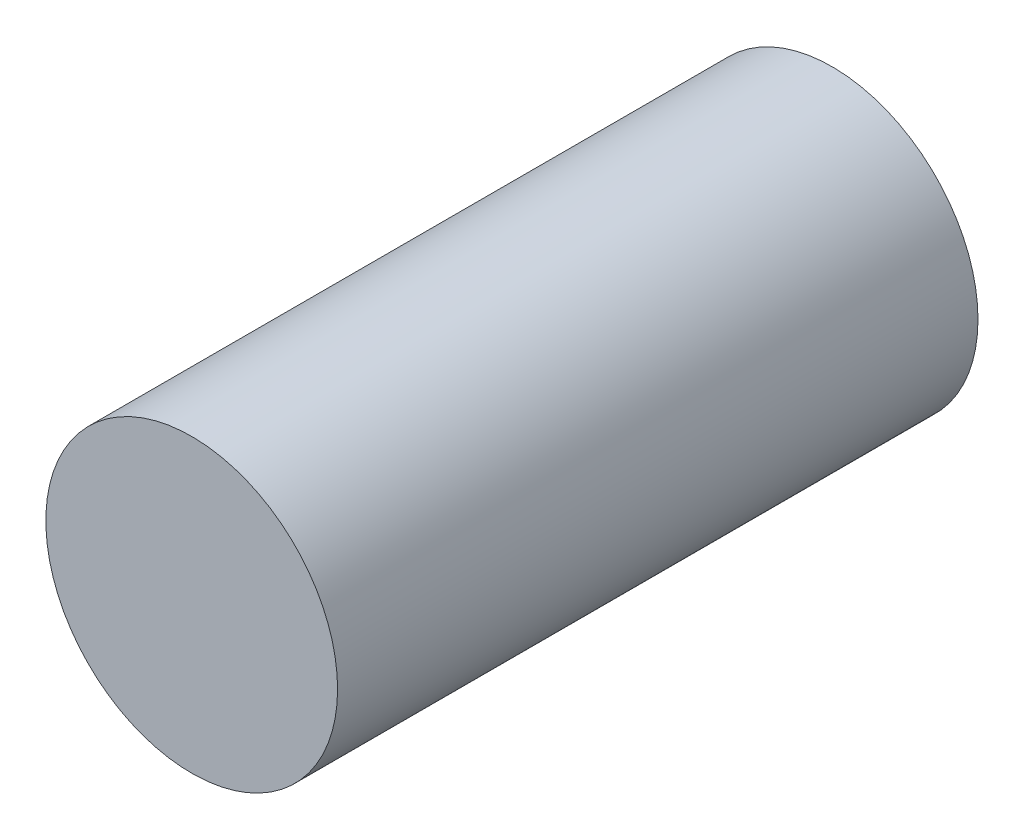
ISO-10303-21;
HEADER;
FILE_DESCRIPTION(('STEP AP214'),'2;1');
FILE_NAME('part.step','',(''),(''),'','','');
FILE_SCHEMA(('AUTOMOTIVE_DESIGN { 1 0 10303 214 1 1 1 1 }'));
ENDSEC;
DATA;
#1=APPLICATION_CONTEXT('core data for automotive mechanical design processes');
#2=APPLICATION_PROTOCOL_DEFINITION('international standard','automotive_design',2000,#1);
#3=PRODUCT_CONTEXT('',#1,'mechanical');
#4=PRODUCT('Part','Part','',(#3));
#5=PRODUCT_RELATED_PRODUCT_CATEGORY('part','',(#4));
#6=PRODUCT_DEFINITION_FORMATION('','',#4);
#7=PRODUCT_DEFINITION_CONTEXT('part definition',#1,'design');
#8=PRODUCT_DEFINITION('design','',#6,#7);
#9=PRODUCT_DEFINITION_SHAPE('','',#8);
#10=(LENGTH_UNIT() NAMED_UNIT(*) SI_UNIT(.MILLI.,.METRE.));
#11=(NAMED_UNIT(*) PLANE_ANGLE_UNIT() SI_UNIT($,.RADIAN.));
#12=(NAMED_UNIT(*) SI_UNIT($,.STERADIAN.) SOLID_ANGLE_UNIT());
#13=UNCERTAINTY_MEASURE_WITH_UNIT(LENGTH_MEASURE(1.E-05),#10,'distance_accuracy_value','');
#14=(GEOMETRIC_REPRESENTATION_CONTEXT(3) GLOBAL_UNCERTAINTY_ASSIGNED_CONTEXT((#13)) GLOBAL_UNIT_ASSIGNED_CONTEXT((#10,
#11,#12)) REPRESENTATION_CONTEXT('',''));
#15=CARTESIAN_POINT('',(0.,0.,0.));
#16=DIRECTION('',(0.,0.,1.));
#17=DIRECTION('',(1.,0.,0.));
#18=AXIS2_PLACEMENT_3D('',#15,#16,#17);
#19=CARTESIAN_POINT('',(0.,1.27,0.1));
#20=DIRECTION('',(0.,0.,1.));
#21=DIRECTION('',(1.,0.,0.));
#22=AXIS2_PLACEMENT_3D('',#19,#20,#21);
#23=PLANE('',#22);
#24=CARTESIAN_POINT('',(0.,1.27,0.1));
#25=DIRECTION('',(0.,0.,1.));
#26=DIRECTION('',(1.,0.,0.));
#27=AXIS2_PLACEMENT_3D('',#24,#25,#26);
#28=CIRCLE('',#27,0.41);
#29=CARTESIAN_POINT('',(0.41,1.27,0.1));
#30=VERTEX_POINT('',#29);
#31=EDGE_CURVE('E17',#30,#30,#28,.F.);
#32=ORIENTED_EDGE('',*,*,#31,.F.);
#33=EDGE_LOOP('',(#32));
#34=FACE_BOUND('',#33,.T.);
#35=ADVANCED_FACE('F14',(#34),#23,.T.);
#36=CARTESIAN_POINT('',(0.,1.27,-1.7));
#37=DIRECTION('',(0.,0.,1.));
#38=DIRECTION('',(1.,0.,0.));
#39=AXIS2_PLACEMENT_3D('',#36,#37,#38);
#40=PLANE('',#39);
#41=CARTESIAN_POINT('',(0.,1.27,-1.7));
#42=DIRECTION('',(0.,0.,1.));
#43=DIRECTION('',(1.,0.,0.));
#44=AXIS2_PLACEMENT_3D('',#41,#42,#43);
#45=CIRCLE('',#44,0.41);
#46=CARTESIAN_POINT('',(0.41,1.27,-1.7));
#47=VERTEX_POINT('',#46);
#48=EDGE_CURVE('E10',#47,#47,#45,.T.);
#49=ORIENTED_EDGE('',*,*,#48,.F.);
#50=EDGE_LOOP('',(#49));
#51=FACE_BOUND('',#50,.T.);
#52=ADVANCED_FACE('F29',(#51),#40,.F.);
#53=CARTESIAN_POINT('',(0.,1.27,-1.7));
#54=DIRECTION('',(0.,0.,1.));
#55=DIRECTION('',(1.,0.,0.));
#56=AXIS2_PLACEMENT_3D('',#53,#54,#55);
#57=CYLINDRICAL_SURFACE('',#56,0.41);
#58=ORIENTED_EDGE('',*,*,#48,.T.);
#59=EDGE_LOOP('',(#58));
#60=FACE_BOUND('',#59,.T.);
#61=ORIENTED_EDGE('',*,*,#31,.T.);
#62=EDGE_LOOP('',(#61));
#63=FACE_BOUND('',#62,.T.);
#64=ADVANCED_FACE('F26',(#60,#63),#57,.T.);
#65=CLOSED_SHELL('',(#35,#52,#64));
#66=MANIFOLD_SOLID_BREP('B1',#65);
#67=ADVANCED_BREP_SHAPE_REPRESENTATION('',(#18,#66),#14);
#68=SHAPE_DEFINITION_REPRESENTATION(#9,#67);
ENDSEC;
END-ISO-10303-21;
